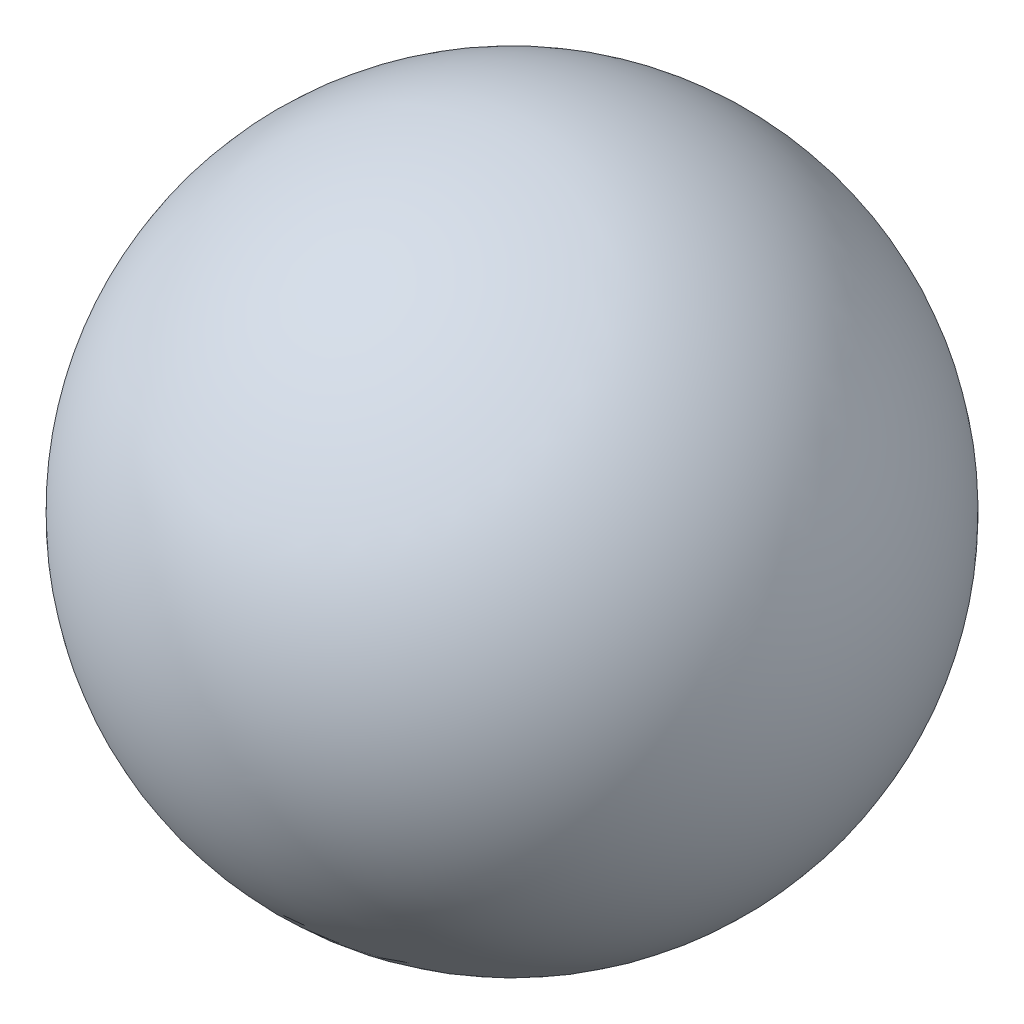
ISO-10303-21;
HEADER;
FILE_DESCRIPTION(('STEP AP214'),'2;1');
FILE_NAME('part.step','',(''),(''),'','','');
FILE_SCHEMA(('AUTOMOTIVE_DESIGN { 1 0 10303 214 1 1 1 1 }'));
ENDSEC;
DATA;
#1=APPLICATION_CONTEXT('core data for automotive mechanical design processes');
#2=APPLICATION_PROTOCOL_DEFINITION('international standard','automotive_design',2000,#1);
#3=PRODUCT_CONTEXT('',#1,'mechanical');
#4=PRODUCT('Part','Part','',(#3));
#5=PRODUCT_RELATED_PRODUCT_CATEGORY('part','',(#4));
#6=PRODUCT_DEFINITION_FORMATION('','',#4);
#7=PRODUCT_DEFINITION_CONTEXT('part definition',#1,'design');
#8=PRODUCT_DEFINITION('design','',#6,#7);
#9=PRODUCT_DEFINITION_SHAPE('','',#8);
#10=(LENGTH_UNIT() NAMED_UNIT(*) SI_UNIT(.MILLI.,.METRE.));
#11=(NAMED_UNIT(*) PLANE_ANGLE_UNIT() SI_UNIT($,.RADIAN.));
#12=(NAMED_UNIT(*) SI_UNIT($,.STERADIAN.) SOLID_ANGLE_UNIT());
#13=UNCERTAINTY_MEASURE_WITH_UNIT(LENGTH_MEASURE(1.E-05),#10,'distance_accuracy_value','');
#14=(GEOMETRIC_REPRESENTATION_CONTEXT(3) GLOBAL_UNCERTAINTY_ASSIGNED_CONTEXT((#13)) GLOBAL_UNIT_ASSIGNED_CONTEXT((#10,
#11,#12)) REPRESENTATION_CONTEXT('',''));
#15=CARTESIAN_POINT('',(0.,0.,0.));
#16=DIRECTION('',(0.,0.,1.));
#17=DIRECTION('',(1.,0.,0.));
#18=AXIS2_PLACEMENT_3D('',#15,#16,#17);
#19=CARTESIAN_POINT('',(57.535,38.4137857836715,48.0677288210729));
#20=DIRECTION('',(0.,0.624294642316075,0.781188965344138));
#21=DIRECTION('',(0.173648177666934,-0.769320949638491,0.614810203916853));
#22=AXIS2_PLACEMENT_3D('',#19,#20,#21);
#23=SPHERICAL_SURFACE('',#22,6.75);
#24=CARTESIAN_POINT('',(57.535,42.627774619305,53.3407543371458));
#25=VERTEX_POINT('',#24);
#26=VERTEX_LOOP('',#25);
#27=FACE_BOUND('',#26,.T.);
#28=CARTESIAN_POINT('',(57.535,34.199796948038,42.794703305));
#29=VERTEX_POINT('',#28);
#30=VERTEX_LOOP('',#29);
#31=FACE_BOUND('',#30,.T.);
#32=ADVANCED_FACE('F16',(#27,#31),#23,.T.);
#33=CLOSED_SHELL('',(#32));
#34=MANIFOLD_SOLID_BREP('B1',#33);
#35=ADVANCED_BREP_SHAPE_REPRESENTATION('',(#18,#34),#14);
#36=SHAPE_DEFINITION_REPRESENTATION(#9,#35);
ENDSEC;
END-ISO-10303-21;
